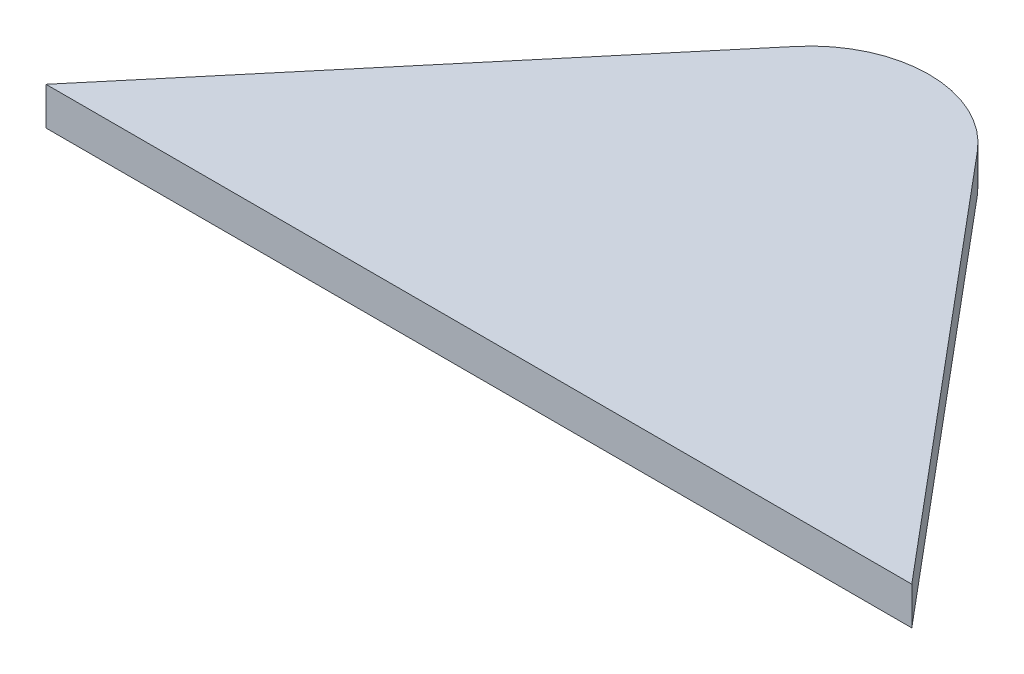
ISO-10303-21;
HEADER;
FILE_DESCRIPTION(('STEP AP214'),'2;1');
FILE_NAME('part.step','',(''),(''),'','','');
FILE_SCHEMA(('AUTOMOTIVE_DESIGN { 1 0 10303 214 1 1 1 1 }'));
ENDSEC;
DATA;
#1=APPLICATION_CONTEXT('core data for automotive mechanical design processes');
#2=APPLICATION_PROTOCOL_DEFINITION('international standard','automotive_design',2000,#1);
#3=PRODUCT_CONTEXT('',#1,'mechanical');
#4=PRODUCT('Part','Part','',(#3));
#5=PRODUCT_RELATED_PRODUCT_CATEGORY('part','',(#4));
#6=PRODUCT_DEFINITION_FORMATION('','',#4);
#7=PRODUCT_DEFINITION_CONTEXT('part definition',#1,'design');
#8=PRODUCT_DEFINITION('design','',#6,#7);
#9=PRODUCT_DEFINITION_SHAPE('','',#8);
#10=(LENGTH_UNIT() NAMED_UNIT(*) SI_UNIT(.MILLI.,.METRE.));
#11=(NAMED_UNIT(*) PLANE_ANGLE_UNIT() SI_UNIT($,.RADIAN.));
#12=(NAMED_UNIT(*) SI_UNIT($,.STERADIAN.) SOLID_ANGLE_UNIT());
#13=UNCERTAINTY_MEASURE_WITH_UNIT(LENGTH_MEASURE(1.E-05),#10,'distance_accuracy_value','');
#14=(GEOMETRIC_REPRESENTATION_CONTEXT(3) GLOBAL_UNCERTAINTY_ASSIGNED_CONTEXT((#13)) GLOBAL_UNIT_ASSIGNED_CONTEXT((#10,
#11,#12)) REPRESENTATION_CONTEXT('',''));
#15=CARTESIAN_POINT('',(0.,0.,0.));
#16=DIRECTION('',(0.,0.,1.));
#17=DIRECTION('',(1.,0.,0.));
#18=AXIS2_PLACEMENT_3D('',#15,#16,#17);
#19=CARTESIAN_POINT('',(-1177.70097323601,35.56,196.85));
#20=DIRECTION('',(0.,1.,0.));
#21=DIRECTION('',(0.,0.,1.));
#22=AXIS2_PLACEMENT_3D('',#19,#20,#21);
#23=CYLINDRICAL_SURFACE('',#22,7.93750000000021);
#24=CARTESIAN_POINT('',(-1177.70097323601,38.1,196.85));
#25=DIRECTION('',(0.,1.,0.));
#26=DIRECTION('',(0.,0.,1.));
#27=AXIS2_PLACEMENT_3D('',#24,#25,#26);
#28=CIRCLE('',#27,7.93750000000021);
#29=CARTESIAN_POINT('',(-1183.78145100327,38.1,191.747873348113));
#30=VERTEX_POINT('',#29);
#31=CARTESIAN_POINT('',(-1171.62049546875,38.1,191.747873348113));
#32=VERTEX_POINT('',#31);
#33=EDGE_CURVE('E11',#30,#32,#28,.F.);
#34=ORIENTED_EDGE('',*,*,#33,.T.);
#35=DIRECTION('',(0.,1.,0.));
#36=VECTOR('',#35,1.);
#37=CARTESIAN_POINT('',(-1171.62049546875,35.56,191.747873348113));
#38=LINE('',#37,#36);
#39=CARTESIAN_POINT('',(-1171.62049546875,35.56,191.747873348113));
#40=VERTEX_POINT('',#39);
#41=EDGE_CURVE('E83',#40,#32,#38,.T.);
#42=ORIENTED_EDGE('',*,*,#41,.F.);
#43=CARTESIAN_POINT('',(-1177.70097323601,35.56,196.85));
#44=DIRECTION('',(0.,1.,0.));
#45=DIRECTION('',(0.,0.,1.));
#46=AXIS2_PLACEMENT_3D('',#43,#44,#45);
#47=CIRCLE('',#46,7.93750000000021);
#48=CARTESIAN_POINT('',(-1183.78145100327,35.56,191.747873348113));
#49=VERTEX_POINT('',#48);
#50=EDGE_CURVE('E40',#49,#40,#47,.F.);
#51=ORIENTED_EDGE('',*,*,#50,.F.);
#52=DIRECTION('',(0.,1.,0.));
#53=VECTOR('',#52,1.);
#54=CARTESIAN_POINT('',(-1183.78145100327,35.56,191.747873348113));
#55=LINE('',#54,#53);
#56=EDGE_CURVE('E105',#49,#30,#55,.T.);
#57=ORIENTED_EDGE('',*,*,#56,.T.);
#58=EDGE_LOOP('',(#34,#42,#51,#57));
#59=FACE_BOUND('',#58,.T.);
#60=ADVANCED_FACE('F36',(#59),#23,.T.);
#61=CARTESIAN_POINT('',(-781.952525860489,35.56,656.136076047664));
#62=DIRECTION('',(0.766044443118985,0.,-0.642787609686531));
#63=DIRECTION('',(-0.642787609686531,0.,-0.766044443118985));
#64=AXIS2_PLACEMENT_3D('',#61,#62,#63);
#65=PLANE('',#64);
#66=DIRECTION('',(-0.642787609686531,0.,-0.766044443118985));
#67=VECTOR('',#66,1.);
#68=CARTESIAN_POINT('',(-781.952525860489,38.1,656.136076047664));
#69=LINE('',#68,#67);
#70=CARTESIAN_POINT('',(-1148.69031357402,38.1,219.075));
#71=VERTEX_POINT('',#70);
#72=EDGE_CURVE('E96',#71,#32,#69,.T.);
#73=ORIENTED_EDGE('',*,*,#72,.F.);
#74=DIRECTION('',(0.,1.,0.));
#75=VECTOR('',#74,1.);
#76=CARTESIAN_POINT('',(-1148.69031357402,35.56,219.075));
#77=LINE('',#76,#75);
#78=CARTESIAN_POINT('',(-1148.69031357402,35.56,219.075));
#79=VERTEX_POINT('',#78);
#80=EDGE_CURVE('E85',#79,#71,#77,.T.);
#81=ORIENTED_EDGE('',*,*,#80,.F.);
#82=DIRECTION('',(-0.642787609686531,0.,-0.766044443118985));
#83=VECTOR('',#82,1.);
#84=CARTESIAN_POINT('',(-781.952525860489,35.56,656.136076047664));
#85=LINE('',#84,#83);
#86=EDGE_CURVE('E103',#79,#40,#85,.T.);
#87=ORIENTED_EDGE('',*,*,#86,.T.);
#88=ORIENTED_EDGE('',*,*,#41,.T.);
#89=EDGE_LOOP('',(#73,#81,#87,#88));
#90=FACE_BOUND('',#89,.T.);
#91=ADVANCED_FACE('F98',(#90),#65,.T.);
#92=CARTESIAN_POINT('',(0.,35.56,219.075));
#93=DIRECTION('',(0.,0.,1.));
#94=DIRECTION('',(1.,0.,0.));
#95=AXIS2_PLACEMENT_3D('',#92,#93,#94);
#96=PLANE('',#95);
#97=DIRECTION('',(1.,0.,0.));
#98=VECTOR('',#97,1.);
#99=CARTESIAN_POINT('',(0.,38.1,219.075));
#100=LINE('',#99,#98);
#101=CARTESIAN_POINT('',(-1206.711632898,38.1,219.075));
#102=VERTEX_POINT('',#101);
#103=EDGE_CURVE('E88',#102,#71,#100,.T.);
#104=ORIENTED_EDGE('',*,*,#103,.F.);
#105=DIRECTION('',(0.,1.,0.));
#106=VECTOR('',#105,1.);
#107=CARTESIAN_POINT('',(-1206.711632898,35.56,219.075));
#108=LINE('',#107,#106);
#109=CARTESIAN_POINT('',(-1206.711632898,35.56,219.075));
#110=VERTEX_POINT('',#109);
#111=EDGE_CURVE('E70',#110,#102,#108,.T.);
#112=ORIENTED_EDGE('',*,*,#111,.F.);
#113=DIRECTION('',(1.,0.,0.));
#114=VECTOR('',#113,1.);
#115=CARTESIAN_POINT('',(0.,35.56,219.075));
#116=LINE('',#115,#114);
#117=EDGE_CURVE('E89',#110,#79,#116,.T.);
#118=ORIENTED_EDGE('',*,*,#117,.T.);
#119=ORIENTED_EDGE('',*,*,#80,.T.);
#120=EDGE_LOOP('',(#104,#112,#118,#119));
#121=FACE_BOUND('',#120,.T.);
#122=ADVANCED_FACE('F87',(#121),#96,.T.);
#123=CARTESIAN_POINT('',(-600.254075214543,35.56,-503.672973125177));
#124=DIRECTION('',(0.766044443118981,0.,0.642787609686535));
#125=DIRECTION('',(0.642787609686535,0.,-0.766044443118981));
#126=AXIS2_PLACEMENT_3D('',#123,#124,#125);
#127=PLANE('',#126);
#128=DIRECTION('',(0.642787609686535,0.,-0.766044443118981));
#129=VECTOR('',#128,1.);
#130=CARTESIAN_POINT('',(-600.254075214543,38.1,-503.672973125177));
#131=LINE('',#130,#129);
#132=EDGE_CURVE('E46',#102,#30,#131,.T.);
#133=ORIENTED_EDGE('',*,*,#132,.T.);
#134=ORIENTED_EDGE('',*,*,#56,.F.);
#135=DIRECTION('',(0.642787609686535,0.,-0.766044443118981));
#136=VECTOR('',#135,1.);
#137=CARTESIAN_POINT('',(-600.254075214543,35.56,-503.672973125177));
#138=LINE('',#137,#136);
#139=EDGE_CURVE('E76',#110,#49,#138,.T.);
#140=ORIENTED_EDGE('',*,*,#139,.F.);
#141=ORIENTED_EDGE('',*,*,#111,.T.);
#142=EDGE_LOOP('',(#133,#134,#140,#141));
#143=FACE_BOUND('',#142,.T.);
#144=ADVANCED_FACE('F110',(#143),#127,.F.);
#145=CARTESIAN_POINT('',(0.,35.56,0.));
#146=DIRECTION('',(0.,1.,0.));
#147=DIRECTION('',(0.,0.,1.));
#148=AXIS2_PLACEMENT_3D('',#145,#146,#147);
#149=PLANE('',#148);
#150=ORIENTED_EDGE('',*,*,#50,.T.);
#151=ORIENTED_EDGE('',*,*,#86,.F.);
#152=ORIENTED_EDGE('',*,*,#117,.F.);
#153=ORIENTED_EDGE('',*,*,#139,.T.);
#154=EDGE_LOOP('',(#150,#151,#152,#153));
#155=FACE_BOUND('',#154,.T.);
#156=ADVANCED_FACE('F38',(#155),#149,.F.);
#157=CARTESIAN_POINT('',(0.,38.1,0.));
#158=DIRECTION('',(0.,1.,0.));
#159=DIRECTION('',(0.,0.,1.));
#160=AXIS2_PLACEMENT_3D('',#157,#158,#159);
#161=PLANE('',#160);
#162=ORIENTED_EDGE('',*,*,#33,.F.);
#163=ORIENTED_EDGE('',*,*,#132,.F.);
#164=ORIENTED_EDGE('',*,*,#103,.T.);
#165=ORIENTED_EDGE('',*,*,#72,.T.);
#166=EDGE_LOOP('',(#162,#163,#164,#165));
#167=FACE_BOUND('',#166,.T.);
#168=ADVANCED_FACE('F95',(#167),#161,.T.);
#169=CLOSED_SHELL('',(#60,#91,#122,#144,#156,#168));
#170=MANIFOLD_SOLID_BREP('B2',#169);
#171=ADVANCED_BREP_SHAPE_REPRESENTATION('',(#18,#170),#14);
#172=SHAPE_DEFINITION_REPRESENTATION(#9,#171);
ENDSEC;
END-ISO-10303-21;
